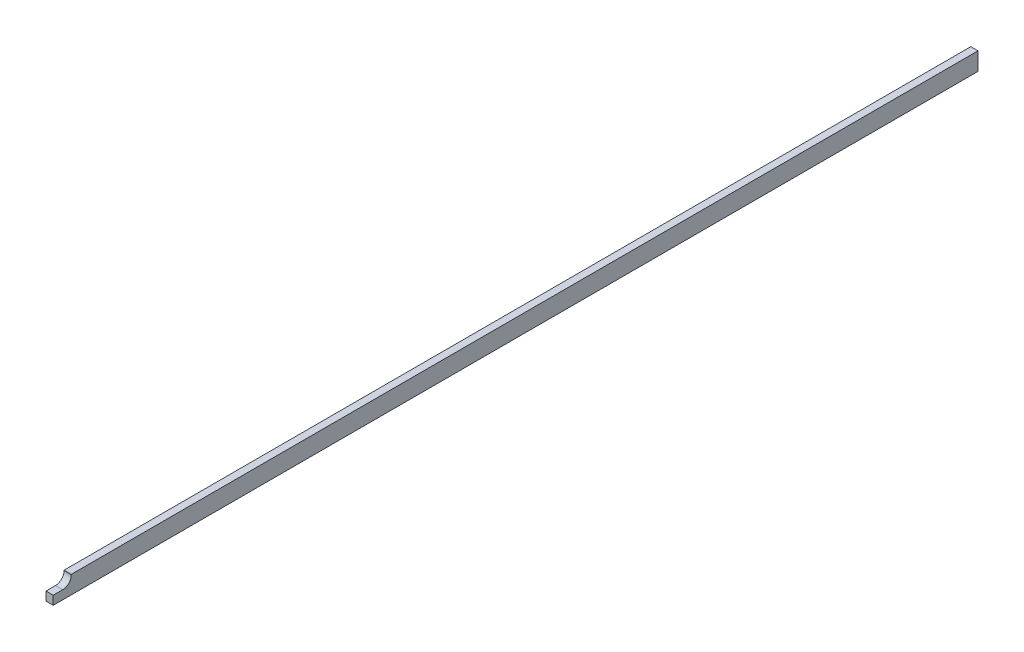
ISO-10303-21;
HEADER;
FILE_DESCRIPTION(('STEP AP214'),'2;1');
FILE_NAME('part.step','',(''),(''),'','','');
FILE_SCHEMA(('AUTOMOTIVE_DESIGN { 1 0 10303 214 1 1 1 1 }'));
ENDSEC;
DATA;
#1=APPLICATION_CONTEXT('core data for automotive mechanical design processes');
#2=APPLICATION_PROTOCOL_DEFINITION('international standard','automotive_design',2000,#1);
#3=PRODUCT_CONTEXT('',#1,'mechanical');
#4=PRODUCT('Part','Part','',(#3));
#5=PRODUCT_RELATED_PRODUCT_CATEGORY('part','',(#4));
#6=PRODUCT_DEFINITION_FORMATION('','',#4);
#7=PRODUCT_DEFINITION_CONTEXT('part definition',#1,'design');
#8=PRODUCT_DEFINITION('design','',#6,#7);
#9=PRODUCT_DEFINITION_SHAPE('','',#8);
#10=(LENGTH_UNIT() NAMED_UNIT(*) SI_UNIT(.MILLI.,.METRE.));
#11=(NAMED_UNIT(*) PLANE_ANGLE_UNIT() SI_UNIT($,.RADIAN.));
#12=(NAMED_UNIT(*) SI_UNIT($,.STERADIAN.) SOLID_ANGLE_UNIT());
#13=UNCERTAINTY_MEASURE_WITH_UNIT(LENGTH_MEASURE(1.E-05),#10,'distance_accuracy_value','');
#14=(GEOMETRIC_REPRESENTATION_CONTEXT(3) GLOBAL_UNCERTAINTY_ASSIGNED_CONTEXT((#13)) GLOBAL_UNIT_ASSIGNED_CONTEXT((#10,
#11,#12)) REPRESENTATION_CONTEXT('',''));
#15=CARTESIAN_POINT('',(0.,0.,0.));
#16=DIRECTION('',(0.,0.,1.));
#17=DIRECTION('',(1.,0.,0.));
#18=AXIS2_PLACEMENT_3D('',#15,#16,#17);
#19=CARTESIAN_POINT('',(0.8,-1.975,205.));
#20=DIRECTION('',(-1.,0.,0.));
#21=DIRECTION('',(0.,0.,1.));
#22=AXIS2_PLACEMENT_3D('',#19,#20,#21);
#23=PLANE('',#22);
#24=DIRECTION('',(0.,0.,-1.));
#25=VECTOR('',#24,1.);
#26=CARTESIAN_POINT('',(0.8,1.975,205.));
#27=LINE('',#26,#25);
#28=CARTESIAN_POINT('',(0.8,1.975,201.));
#29=VERTEX_POINT('',#28);
#30=CARTESIAN_POINT('',(0.8,1.975,0.));
#31=VERTEX_POINT('',#30);
#32=EDGE_CURVE('E112',#29,#31,#27,.T.);
#33=ORIENTED_EDGE('',*,*,#32,.F.);
#34=DIRECTION('',(0.,1.,0.));
#35=VECTOR('',#34,1.);
#36=CARTESIAN_POINT('',(0.8,1.975,201.));
#37=LINE('',#36,#35);
#38=CARTESIAN_POINT('',(0.8,1.87500000000001,201.));
#39=VERTEX_POINT('',#38);
#40=EDGE_CURVE('E139',#39,#29,#37,.T.);
#41=ORIENTED_EDGE('',*,*,#40,.F.);
#42=CARTESIAN_POINT('',(0.8,1.875,202.9));
#43=DIRECTION('',(1.,0.,0.));
#44=DIRECTION('',(0.,0.,-1.));
#45=AXIS2_PLACEMENT_3D('',#42,#43,#44);
#46=CIRCLE('',#45,1.90000000000001);
#47=CARTESIAN_POINT('',(0.8,-0.025000000000007,202.9));
#48=VERTEX_POINT('',#47);
#49=EDGE_CURVE('E143',#48,#39,#46,.T.);
#50=ORIENTED_EDGE('',*,*,#49,.F.);
#51=DIRECTION('',(0.,0.,-1.));
#52=VECTOR('',#51,1.);
#53=CARTESIAN_POINT('',(0.8,-0.0250000000000003,205.));
#54=LINE('',#53,#52);
#55=CARTESIAN_POINT('',(0.8,-0.0250000000000003,205.));
#56=VERTEX_POINT('',#55);
#57=EDGE_CURVE('E137',#56,#48,#54,.T.);
#58=ORIENTED_EDGE('',*,*,#57,.F.);
#59=DIRECTION('',(0.,1.,0.));
#60=VECTOR('',#59,1.);
#61=CARTESIAN_POINT('',(0.8,-1.975,205.));
#62=LINE('',#61,#60);
#63=CARTESIAN_POINT('',(0.8,-1.975,205.));
#64=VERTEX_POINT('',#63);
#65=EDGE_CURVE('E88',#64,#56,#62,.T.);
#66=ORIENTED_EDGE('',*,*,#65,.F.);
#67=DIRECTION('',(0.,0.,-1.));
#68=VECTOR('',#67,1.);
#69=CARTESIAN_POINT('',(0.8,-1.975,205.));
#70=LINE('',#69,#68);
#71=CARTESIAN_POINT('',(0.8,-1.975,0.));
#72=VERTEX_POINT('',#71);
#73=EDGE_CURVE('E81',#64,#72,#70,.T.);
#74=ORIENTED_EDGE('',*,*,#73,.T.);
#75=DIRECTION('',(0.,1.,0.));
#76=VECTOR('',#75,1.);
#77=CARTESIAN_POINT('',(0.8,-1.975,0.));
#78=LINE('',#77,#76);
#79=EDGE_CURVE('E94',#72,#31,#78,.T.);
#80=ORIENTED_EDGE('',*,*,#79,.T.);
#81=EDGE_LOOP('',(#33,#41,#50,#58,#66,#74,#80));
#82=FACE_BOUND('',#81,.T.);
#83=ADVANCED_FACE('F36',(#82),#23,.F.);
#84=CARTESIAN_POINT('',(-0.8,1.975,205.));
#85=DIRECTION('',(0.,-1.,0.));
#86=DIRECTION('',(0.,0.,-1.));
#87=AXIS2_PLACEMENT_3D('',#84,#85,#86);
#88=PLANE('',#87);
#89=DIRECTION('',(0.,0.,-1.));
#90=VECTOR('',#89,1.);
#91=CARTESIAN_POINT('',(-0.8,1.975,205.));
#92=LINE('',#91,#90);
#93=CARTESIAN_POINT('',(-0.800000000000051,1.975,201.));
#94=VERTEX_POINT('',#93);
#95=CARTESIAN_POINT('',(-0.8,1.975,0.));
#96=VERTEX_POINT('',#95);
#97=EDGE_CURVE('E110',#94,#96,#92,.T.);
#98=ORIENTED_EDGE('',*,*,#97,.F.);
#99=DIRECTION('',(1.,0.,0.));
#100=VECTOR('',#99,1.);
#101=CARTESIAN_POINT('',(-204.2,1.975,201.));
#102=LINE('',#101,#100);
#103=EDGE_CURVE('E103',#94,#29,#102,.T.);
#104=ORIENTED_EDGE('',*,*,#103,.T.);
#105=ORIENTED_EDGE('',*,*,#32,.T.);
#106=DIRECTION('',(-1.,0.,0.));
#107=VECTOR('',#106,1.);
#108=CARTESIAN_POINT('',(-0.8,1.975,0.));
#109=LINE('',#108,#107);
#110=EDGE_CURVE('E100',#31,#96,#109,.T.);
#111=ORIENTED_EDGE('',*,*,#110,.T.);
#112=EDGE_LOOP('',(#98,#104,#105,#111));
#113=FACE_BOUND('',#112,.T.);
#114=ADVANCED_FACE('F151',(#113),#88,.F.);
#115=CARTESIAN_POINT('',(-0.8,-1.975,205.));
#116=DIRECTION('',(1.,0.,0.));
#117=DIRECTION('',(0.,0.,-1.));
#118=AXIS2_PLACEMENT_3D('',#115,#116,#117);
#119=PLANE('',#118);
#120=CARTESIAN_POINT('',(-0.799999999999995,1.875,202.9));
#121=DIRECTION('',(1.,0.,0.));
#122=DIRECTION('',(0.,0.,-1.));
#123=AXIS2_PLACEMENT_3D('',#120,#121,#122);
#124=CIRCLE('',#123,1.90000000000001);
#125=CARTESIAN_POINT('',(-0.800000000000051,-0.025000000000007,202.9));
#126=VERTEX_POINT('',#125);
#127=CARTESIAN_POINT('',(-0.800000000000051,1.87500000000001,201.));
#128=VERTEX_POINT('',#127);
#129=EDGE_CURVE('E43',#126,#128,#124,.T.);
#130=ORIENTED_EDGE('',*,*,#129,.T.);
#131=DIRECTION('',(0.,1.,0.));
#132=VECTOR('',#131,1.);
#133=CARTESIAN_POINT('',(-0.8,-1.975,201.));
#134=LINE('',#133,#132);
#135=EDGE_CURVE('E11',#128,#94,#134,.T.);
#136=ORIENTED_EDGE('',*,*,#135,.T.);
#137=ORIENTED_EDGE('',*,*,#97,.T.);
#138=DIRECTION('',(0.,-1.,0.));
#139=VECTOR('',#138,1.);
#140=CARTESIAN_POINT('',(-0.8,-1.975,0.));
#141=LINE('',#140,#139);
#142=CARTESIAN_POINT('',(-0.8,-1.975,0.));
#143=VERTEX_POINT('',#142);
#144=EDGE_CURVE('E89',#96,#143,#141,.T.);
#145=ORIENTED_EDGE('',*,*,#144,.T.);
#146=DIRECTION('',(0.,0.,-1.));
#147=VECTOR('',#146,1.);
#148=CARTESIAN_POINT('',(-0.8,-1.975,205.));
#149=LINE('',#148,#147);
#150=CARTESIAN_POINT('',(-0.8,-1.975,205.));
#151=VERTEX_POINT('',#150);
#152=EDGE_CURVE('E84',#151,#143,#149,.T.);
#153=ORIENTED_EDGE('',*,*,#152,.F.);
#154=DIRECTION('',(0.,-1.,0.));
#155=VECTOR('',#154,1.);
#156=CARTESIAN_POINT('',(-0.8,-1.975,205.));
#157=LINE('',#156,#155);
#158=CARTESIAN_POINT('',(-0.8,-0.0250000000000003,205.));
#159=VERTEX_POINT('',#158);
#160=EDGE_CURVE('E147',#159,#151,#157,.T.);
#161=ORIENTED_EDGE('',*,*,#160,.F.);
#162=DIRECTION('',(0.,0.,-1.));
#163=VECTOR('',#162,1.);
#164=CARTESIAN_POINT('',(-0.8,-0.0250000000000003,205.));
#165=LINE('',#164,#163);
#166=EDGE_CURVE('E50',#159,#126,#165,.T.);
#167=ORIENTED_EDGE('',*,*,#166,.T.);
#168=EDGE_LOOP('',(#130,#136,#137,#145,#153,#161,#167));
#169=FACE_BOUND('',#168,.T.);
#170=ADVANCED_FACE('F118',(#169),#119,.F.);
#171=CARTESIAN_POINT('',(-0.8,-1.975,205.));
#172=DIRECTION('',(0.,1.,0.));
#173=DIRECTION('',(0.,0.,1.));
#174=AXIS2_PLACEMENT_3D('',#171,#172,#173);
#175=PLANE('',#174);
#176=DIRECTION('',(1.,0.,0.));
#177=VECTOR('',#176,1.);
#178=CARTESIAN_POINT('',(-0.8,-1.975,0.));
#179=LINE('',#178,#177);
#180=EDGE_CURVE('E78',#143,#72,#179,.T.);
#181=ORIENTED_EDGE('',*,*,#180,.T.);
#182=ORIENTED_EDGE('',*,*,#73,.F.);
#183=DIRECTION('',(1.,0.,0.));
#184=VECTOR('',#183,1.);
#185=CARTESIAN_POINT('',(-0.8,-1.975,205.));
#186=LINE('',#185,#184);
#187=EDGE_CURVE('E59',#151,#64,#186,.T.);
#188=ORIENTED_EDGE('',*,*,#187,.F.);
#189=ORIENTED_EDGE('',*,*,#152,.T.);
#190=EDGE_LOOP('',(#181,#182,#188,#189));
#191=FACE_BOUND('',#190,.T.);
#192=ADVANCED_FACE('F80',(#191),#175,.F.);
#193=CARTESIAN_POINT('',(0.,0.,205.));
#194=DIRECTION('',(0.,0.,-1.));
#195=DIRECTION('',(-1.,0.,0.));
#196=AXIS2_PLACEMENT_3D('',#193,#194,#195);
#197=PLANE('',#196);
#198=ORIENTED_EDGE('',*,*,#65,.T.);
#199=DIRECTION('',(-1.,0.,0.));
#200=VECTOR('',#199,1.);
#201=CARTESIAN_POINT('',(0.,-0.0250000000000003,205.));
#202=LINE('',#201,#200);
#203=EDGE_CURVE('E114',#56,#159,#202,.T.);
#204=ORIENTED_EDGE('',*,*,#203,.T.);
#205=ORIENTED_EDGE('',*,*,#160,.T.);
#206=ORIENTED_EDGE('',*,*,#187,.T.);
#207=EDGE_LOOP('',(#198,#204,#205,#206));
#208=FACE_BOUND('',#207,.T.);
#209=ADVANCED_FACE('F148',(#208),#197,.F.);
#210=CARTESIAN_POINT('',(0.,0.,0.));
#211=DIRECTION('',(0.,0.,-1.));
#212=DIRECTION('',(-1.,0.,0.));
#213=AXIS2_PLACEMENT_3D('',#210,#211,#212);
#214=PLANE('',#213);
#215=ORIENTED_EDGE('',*,*,#79,.F.);
#216=ORIENTED_EDGE('',*,*,#180,.F.);
#217=ORIENTED_EDGE('',*,*,#144,.F.);
#218=ORIENTED_EDGE('',*,*,#110,.F.);
#219=EDGE_LOOP('',(#215,#216,#217,#218));
#220=FACE_BOUND('',#219,.T.);
#221=ADVANCED_FACE('F98',(#220),#214,.T.);
#222=CARTESIAN_POINT('',(-204.2,1.975,201.));
#223=DIRECTION('',(0.,0.,-1.));
#224=DIRECTION('',(-1.,0.,0.));
#225=AXIS2_PLACEMENT_3D('',#222,#223,#224);
#226=PLANE('',#225);
#227=DIRECTION('',(1.,0.,0.));
#228=VECTOR('',#227,1.);
#229=CARTESIAN_POINT('',(-204.2,1.87500000000001,201.));
#230=LINE('',#229,#228);
#231=EDGE_CURVE('E133',#128,#39,#230,.T.);
#232=ORIENTED_EDGE('',*,*,#231,.T.);
#233=ORIENTED_EDGE('',*,*,#40,.T.);
#234=ORIENTED_EDGE('',*,*,#103,.F.);
#235=ORIENTED_EDGE('',*,*,#135,.F.);
#236=EDGE_LOOP('',(#232,#233,#234,#235));
#237=FACE_BOUND('',#236,.T.);
#238=ADVANCED_FACE('F160',(#237),#226,.F.);
#239=CARTESIAN_POINT('',(-204.2,1.875,202.9));
#240=DIRECTION('',(1.,0.,0.));
#241=DIRECTION('',(0.,0.,-1.));
#242=AXIS2_PLACEMENT_3D('',#239,#240,#241);
#243=CYLINDRICAL_SURFACE('',#242,1.90000000000001);
#244=DIRECTION('',(1.,0.,0.));
#245=VECTOR('',#244,1.);
#246=CARTESIAN_POINT('',(-204.2,-0.025000000000007,202.9));
#247=LINE('',#246,#245);
#248=EDGE_CURVE('E130',#126,#48,#247,.T.);
#249=ORIENTED_EDGE('',*,*,#248,.T.);
#250=ORIENTED_EDGE('',*,*,#49,.T.);
#251=ORIENTED_EDGE('',*,*,#231,.F.);
#252=ORIENTED_EDGE('',*,*,#129,.F.);
#253=EDGE_LOOP('',(#249,#250,#251,#252));
#254=FACE_BOUND('',#253,.T.);
#255=ADVANCED_FACE('F127',(#254),#243,.F.);
#256=CARTESIAN_POINT('',(-204.2,-0.0250000000000003,205.));
#257=DIRECTION('',(0.,-1.,0.));
#258=DIRECTION('',(0.,0.,-1.));
#259=AXIS2_PLACEMENT_3D('',#256,#257,#258);
#260=PLANE('',#259);
#261=ORIENTED_EDGE('',*,*,#203,.F.);
#262=ORIENTED_EDGE('',*,*,#57,.T.);
#263=ORIENTED_EDGE('',*,*,#248,.F.);
#264=ORIENTED_EDGE('',*,*,#166,.F.);
#265=EDGE_LOOP('',(#261,#262,#263,#264));
#266=FACE_BOUND('',#265,.T.);
#267=ADVANCED_FACE('F136',(#266),#260,.F.);
#268=CLOSED_SHELL('',(#83,#114,#170,#192,#209,#221,#238,#255,#267));
#269=MANIFOLD_SOLID_BREP('B2',#268);
#270=ADVANCED_BREP_SHAPE_REPRESENTATION('',(#18,#269),#14);
#271=SHAPE_DEFINITION_REPRESENTATION(#9,#270);
ENDSEC;
END-ISO-10303-21;
